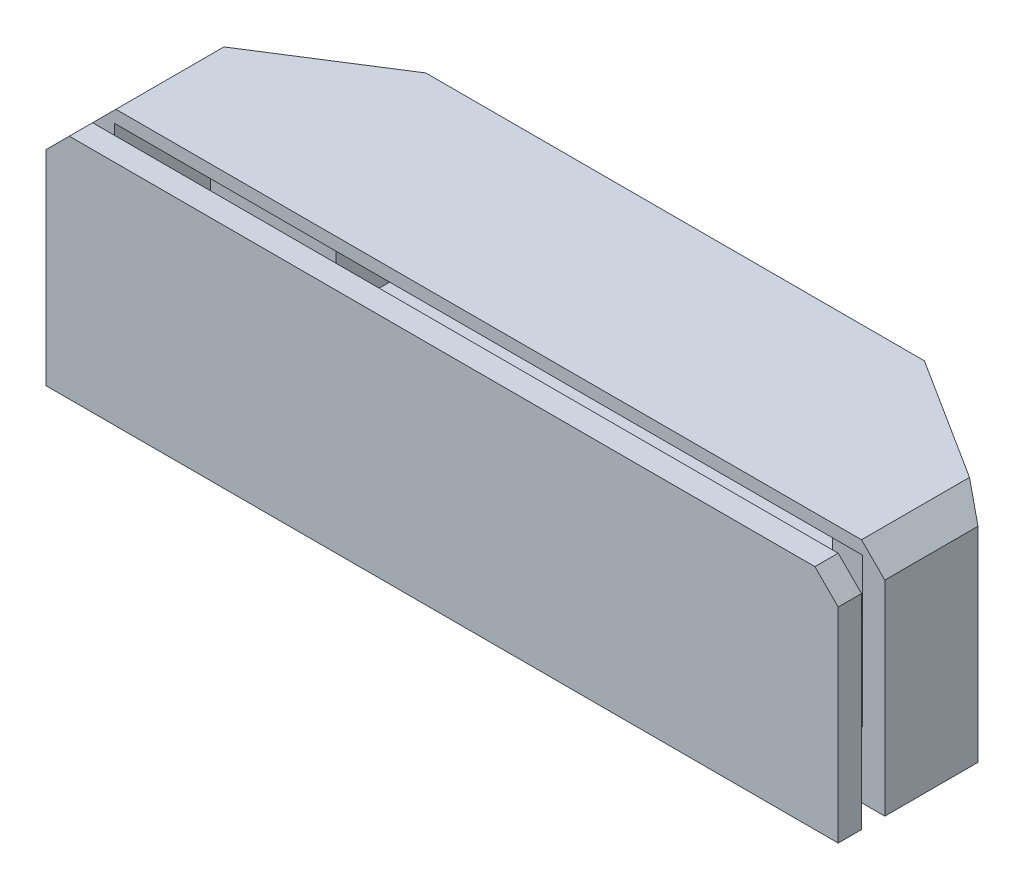
ISO-10303-21;
HEADER;
FILE_DESCRIPTION(('STEP AP214'),'2;1');
FILE_NAME('part.step','',(''),(''),'','','');
FILE_SCHEMA(('AUTOMOTIVE_DESIGN { 1 0 10303 214 1 1 1 1 }'));
ENDSEC;
DATA;
#1=APPLICATION_CONTEXT('core data for automotive mechanical design processes');
#2=APPLICATION_PROTOCOL_DEFINITION('international standard','automotive_design',2000,#1);
#3=PRODUCT_CONTEXT('',#1,'mechanical');
#4=PRODUCT('Part','Part','',(#3));
#5=PRODUCT_RELATED_PRODUCT_CATEGORY('part','',(#4));
#6=PRODUCT_DEFINITION_FORMATION('','',#4);
#7=PRODUCT_DEFINITION_CONTEXT('part definition',#1,'design');
#8=PRODUCT_DEFINITION('design','',#6,#7);
#9=PRODUCT_DEFINITION_SHAPE('','',#8);
#10=(LENGTH_UNIT() NAMED_UNIT(*) SI_UNIT(.MILLI.,.METRE.));
#11=(NAMED_UNIT(*) PLANE_ANGLE_UNIT() SI_UNIT($,.RADIAN.));
#12=(NAMED_UNIT(*) SI_UNIT($,.STERADIAN.) SOLID_ANGLE_UNIT());
#13=UNCERTAINTY_MEASURE_WITH_UNIT(LENGTH_MEASURE(1.E-05),#10,'distance_accuracy_value','');
#14=(GEOMETRIC_REPRESENTATION_CONTEXT(3) GLOBAL_UNCERTAINTY_ASSIGNED_CONTEXT((#13)) GLOBAL_UNIT_ASSIGNED_CONTEXT((#10,
#11,#12)) REPRESENTATION_CONTEXT('',''));
#15=CARTESIAN_POINT('',(0.,0.,0.));
#16=DIRECTION('',(0.,0.,1.));
#17=DIRECTION('',(1.,0.,0.));
#18=AXIS2_PLACEMENT_3D('',#15,#16,#17);
#19=CARTESIAN_POINT('',(-34.,-12.05,11.9446162465853));
#20=DIRECTION('',(0.,1.,0.));
#21=DIRECTION('',(0.,0.,1.));
#22=AXIS2_PLACEMENT_3D('',#19,#20,#21);
#23=PLANE('',#22);
#24=DIRECTION('',(1.,0.,0.));
#25=VECTOR('',#24,1.);
#26=CARTESIAN_POINT('',(-34.,-12.05,9.94461624658526));
#27=LINE('',#26,#25);
#28=CARTESIAN_POINT('',(-34.,-12.05,9.94461624658526));
#29=VERTEX_POINT('',#28);
#30=CARTESIAN_POINT('',(34.,-12.05,9.94461624658526));
#31=VERTEX_POINT('',#30);
#32=EDGE_CURVE('E123',#29,#31,#27,.T.);
#33=ORIENTED_EDGE('',*,*,#32,.T.);
#34=DIRECTION('',(0.,0.,-1.));
#35=VECTOR('',#34,1.);
#36=CARTESIAN_POINT('',(34.,-12.05,11.9446162465853));
#37=LINE('',#36,#35);
#38=CARTESIAN_POINT('',(34.,-12.05,11.9446162465853));
#39=VERTEX_POINT('',#38);
#40=EDGE_CURVE('E108',#39,#31,#37,.T.);
#41=ORIENTED_EDGE('',*,*,#40,.F.);
#42=DIRECTION('',(1.,0.,0.));
#43=VECTOR('',#42,1.);
#44=CARTESIAN_POINT('',(-34.,-12.05,11.9446162465853));
#45=LINE('',#44,#43);
#46=CARTESIAN_POINT('',(-34.,-12.05,11.9446162465853));
#47=VERTEX_POINT('',#46);
#48=EDGE_CURVE('E112',#47,#39,#45,.T.);
#49=ORIENTED_EDGE('',*,*,#48,.F.);
#50=DIRECTION('',(0.,0.,-1.));
#51=VECTOR('',#50,1.);
#52=CARTESIAN_POINT('',(-34.,-12.05,11.9446162465853));
#53=LINE('',#52,#51);
#54=EDGE_CURVE('E125',#47,#29,#53,.T.);
#55=ORIENTED_EDGE('',*,*,#54,.T.);
#56=EDGE_LOOP('',(#33,#41,#49,#55));
#57=FACE_BOUND('',#56,.T.);
#58=ADVANCED_FACE('F50',(#57),#23,.F.);
#59=CARTESIAN_POINT('',(34.,-12.05,11.9446162465853));
#60=DIRECTION('',(-1.,0.,0.));
#61=DIRECTION('',(0.,0.,1.));
#62=AXIS2_PLACEMENT_3D('',#59,#60,#61);
#63=PLANE('',#62);
#64=DIRECTION('',(0.,1.,0.));
#65=VECTOR('',#64,1.);
#66=CARTESIAN_POINT('',(34.,-12.05,9.94461624658526));
#67=LINE('',#66,#65);
#68=CARTESIAN_POINT('',(34.,5.49999999999999,9.94461624658526));
#69=VERTEX_POINT('',#68);
#70=EDGE_CURVE('E151',#31,#69,#67,.T.);
#71=ORIENTED_EDGE('',*,*,#70,.T.);
#72=DIRECTION('',(0.,0.,1.));
#73=VECTOR('',#72,1.);
#74=CARTESIAN_POINT('',(34.,5.49999999999999,11.9446162465853));
#75=LINE('',#74,#73);
#76=CARTESIAN_POINT('',(34.,5.49999999999999,11.9446162465853));
#77=VERTEX_POINT('',#76);
#78=EDGE_CURVE('E74',#69,#77,#75,.T.);
#79=ORIENTED_EDGE('',*,*,#78,.T.);
#80=DIRECTION('',(0.,1.,0.));
#81=VECTOR('',#80,1.);
#82=CARTESIAN_POINT('',(34.,-12.05,11.9446162465853));
#83=LINE('',#82,#81);
#84=EDGE_CURVE('E104',#39,#77,#83,.T.);
#85=ORIENTED_EDGE('',*,*,#84,.F.);
#86=ORIENTED_EDGE('',*,*,#40,.T.);
#87=EDGE_LOOP('',(#71,#79,#85,#86));
#88=FACE_BOUND('',#87,.T.);
#89=ADVANCED_FACE('F106',(#88),#63,.F.);
#90=CARTESIAN_POINT('',(34.,7.5,11.9446162465853));
#91=DIRECTION('',(0.,-1.,0.));
#92=DIRECTION('',(0.,0.,-1.));
#93=AXIS2_PLACEMENT_3D('',#90,#91,#92);
#94=PLANE('',#93);
#95=DIRECTION('',(-1.,0.,0.));
#96=VECTOR('',#95,1.);
#97=CARTESIAN_POINT('',(34.,7.5,11.9446162465853));
#98=LINE('',#97,#96);
#99=CARTESIAN_POINT('',(32.,7.5,11.9446162465853));
#100=VERTEX_POINT('',#99);
#101=CARTESIAN_POINT('',(-32.,7.5,11.9446162465853));
#102=VERTEX_POINT('',#101);
#103=EDGE_CURVE('E111',#100,#102,#98,.T.);
#104=ORIENTED_EDGE('',*,*,#103,.F.);
#105=DIRECTION('',(0.,0.,-1.));
#106=VECTOR('',#105,1.);
#107=CARTESIAN_POINT('',(32.,7.5,11.9446162465853));
#108=LINE('',#107,#106);
#109=CARTESIAN_POINT('',(32.,7.5,9.94461624658526));
#110=VERTEX_POINT('',#109);
#111=EDGE_CURVE('E127',#100,#110,#108,.T.);
#112=ORIENTED_EDGE('',*,*,#111,.T.);
#113=DIRECTION('',(-1.,0.,0.));
#114=VECTOR('',#113,1.);
#115=CARTESIAN_POINT('',(34.,7.5,9.94461624658526));
#116=LINE('',#115,#114);
#117=CARTESIAN_POINT('',(-32.,7.5,9.94461624658526));
#118=VERTEX_POINT('',#117);
#119=EDGE_CURVE('E152',#110,#118,#116,.T.);
#120=ORIENTED_EDGE('',*,*,#119,.T.);
#121=DIRECTION('',(0.,0.,1.));
#122=VECTOR('',#121,1.);
#123=CARTESIAN_POINT('',(-32.,7.5,11.9446162465853));
#124=LINE('',#123,#122);
#125=EDGE_CURVE('E124',#118,#102,#124,.T.);
#126=ORIENTED_EDGE('',*,*,#125,.T.);
#127=EDGE_LOOP('',(#104,#112,#120,#126));
#128=FACE_BOUND('',#127,.T.);
#129=ADVANCED_FACE('F143',(#128),#94,.F.);
#130=CARTESIAN_POINT('',(-34.,7.5,11.9446162465853));
#131=DIRECTION('',(1.,0.,0.));
#132=DIRECTION('',(0.,0.,-1.));
#133=AXIS2_PLACEMENT_3D('',#130,#131,#132);
#134=PLANE('',#133);
#135=DIRECTION('',(0.,-1.,0.));
#136=VECTOR('',#135,1.);
#137=CARTESIAN_POINT('',(-34.,7.5,11.9446162465853));
#138=LINE('',#137,#136);
#139=CARTESIAN_POINT('',(-34.,5.5,11.9446162465853));
#140=VERTEX_POINT('',#139);
#141=EDGE_CURVE('E116',#140,#47,#138,.T.);
#142=ORIENTED_EDGE('',*,*,#141,.F.);
#143=DIRECTION('',(0.,0.,-1.));
#144=VECTOR('',#143,1.);
#145=CARTESIAN_POINT('',(-34.,5.5,11.9446162465853));
#146=LINE('',#145,#144);
#147=CARTESIAN_POINT('',(-34.,5.5,9.94461624658526));
#148=VERTEX_POINT('',#147);
#149=EDGE_CURVE('E12',#140,#148,#146,.T.);
#150=ORIENTED_EDGE('',*,*,#149,.T.);
#151=DIRECTION('',(0.,-1.,0.));
#152=VECTOR('',#151,1.);
#153=CARTESIAN_POINT('',(-34.,7.5,9.94461624658526));
#154=LINE('',#153,#152);
#155=EDGE_CURVE('E120',#148,#29,#154,.T.);
#156=ORIENTED_EDGE('',*,*,#155,.T.);
#157=ORIENTED_EDGE('',*,*,#54,.F.);
#158=EDGE_LOOP('',(#142,#150,#156,#157));
#159=FACE_BOUND('',#158,.T.);
#160=ADVANCED_FACE('F159',(#159),#134,.F.);
#161=CARTESIAN_POINT('',(0.,0.,11.9446162465853));
#162=DIRECTION('',(0.,0.,1.));
#163=DIRECTION('',(1.,0.,0.));
#164=AXIS2_PLACEMENT_3D('',#161,#162,#163);
#165=PLANE('',#164);
#166=ORIENTED_EDGE('',*,*,#84,.T.);
#167=DIRECTION('',(0.707106781186546,-0.707106781186549,0.));
#168=VECTOR('',#167,1.);
#169=CARTESIAN_POINT('',(19.7500000000001,19.75,11.9446162465853));
#170=LINE('',#169,#168);
#171=EDGE_CURVE('E59',#77,#100,#170,.F.);
#172=ORIENTED_EDGE('',*,*,#171,.T.);
#173=ORIENTED_EDGE('',*,*,#103,.T.);
#174=DIRECTION('',(0.707106781186548,0.707106781186548,0.));
#175=VECTOR('',#174,1.);
#176=CARTESIAN_POINT('',(-19.75,19.75,11.9446162465853));
#177=LINE('',#176,#175);
#178=EDGE_CURVE('E66',#102,#140,#177,.F.);
#179=ORIENTED_EDGE('',*,*,#178,.T.);
#180=ORIENTED_EDGE('',*,*,#141,.T.);
#181=ORIENTED_EDGE('',*,*,#48,.T.);
#182=EDGE_LOOP('',(#166,#172,#173,#179,#180,#181));
#183=FACE_BOUND('',#182,.T.);
#184=ADVANCED_FACE('F115',(#183),#165,.T.);
#185=CARTESIAN_POINT('',(0.,0.,9.94461624658526));
#186=DIRECTION('',(0.,0.,1.));
#187=DIRECTION('',(1.,0.,0.));
#188=AXIS2_PLACEMENT_3D('',#185,#186,#187);
#189=PLANE('',#188);
#190=ORIENTED_EDGE('',*,*,#119,.F.);
#191=DIRECTION('',(-0.707106781186546,0.707106781186549,0.));
#192=VECTOR('',#191,1.);
#193=CARTESIAN_POINT('',(32.,7.5,9.94461624658526));
#194=LINE('',#193,#192);
#195=EDGE_CURVE('E136',#110,#69,#194,.F.);
#196=ORIENTED_EDGE('',*,*,#195,.T.);
#197=ORIENTED_EDGE('',*,*,#70,.F.);
#198=ORIENTED_EDGE('',*,*,#32,.F.);
#199=ORIENTED_EDGE('',*,*,#155,.F.);
#200=DIRECTION('',(-0.707106781186548,-0.707106781186548,0.));
#201=VECTOR('',#200,1.);
#202=CARTESIAN_POINT('',(-34.,5.5,9.94461624658526));
#203=LINE('',#202,#201);
#204=EDGE_CURVE('E134',#148,#118,#203,.F.);
#205=ORIENTED_EDGE('',*,*,#204,.T.);
#206=EDGE_LOOP('',(#190,#196,#197,#198,#199,#205));
#207=FACE_BOUND('',#206,.T.);
#208=ADVANCED_FACE('F150',(#207),#189,.F.);
#209=CARTESIAN_POINT('',(32.,7.5,11.9446162465853));
#210=DIRECTION('',(-0.707106781186549,-0.707106781186546,0.));
#211=DIRECTION('',(0.,0.,-1.));
#212=AXIS2_PLACEMENT_3D('',#209,#210,#211);
#213=PLANE('',#212);
#214=ORIENTED_EDGE('',*,*,#171,.F.);
#215=ORIENTED_EDGE('',*,*,#78,.F.);
#216=ORIENTED_EDGE('',*,*,#195,.F.);
#217=ORIENTED_EDGE('',*,*,#111,.F.);
#218=EDGE_LOOP('',(#214,#215,#216,#217));
#219=FACE_BOUND('',#218,.T.);
#220=ADVANCED_FACE('F148',(#219),#213,.F.);
#221=CARTESIAN_POINT('',(-34.,5.5,11.9446162465853));
#222=DIRECTION('',(0.707106781186547,-0.707106781186547,0.));
#223=DIRECTION('',(0.,0.,-1.));
#224=AXIS2_PLACEMENT_3D('',#221,#222,#223);
#225=PLANE('',#224);
#226=ORIENTED_EDGE('',*,*,#178,.F.);
#227=ORIENTED_EDGE('',*,*,#125,.F.);
#228=ORIENTED_EDGE('',*,*,#204,.F.);
#229=ORIENTED_EDGE('',*,*,#149,.F.);
#230=EDGE_LOOP('',(#226,#227,#228,#229));
#231=FACE_BOUND('',#230,.T.);
#232=ADVANCED_FACE('F53',(#231),#225,.F.);
#233=CLOSED_SHELL('',(#58,#89,#129,#160,#184,#208,#220,#232));
#234=MANIFOLD_SOLID_BREP('B2',#233);
#235=CARTESIAN_POINT('',(21.3,6.4,-7.2));
#236=DIRECTION('',(1.,0.,0.));
#237=DIRECTION('',(0.,1.,0.));
#238=AXIS2_PLACEMENT_3D('',#235,#236,#237);
#239=PLANE('',#238);
#240=DIRECTION('',(0.,-1.,0.));
#241=VECTOR('',#240,1.);
#242=CARTESIAN_POINT('',(21.3,6.4,-0.25538375341474));
#243=LINE('',#242,#241);
#244=CARTESIAN_POINT('',(21.3,6.4,-0.25538375341474));
#245=VERTEX_POINT('',#244);
#246=CARTESIAN_POINT('',(21.3,-6.4,-0.25538375341474));
#247=VERTEX_POINT('',#246);
#248=EDGE_CURVE('E388',#245,#247,#243,.T.);
#249=ORIENTED_EDGE('',*,*,#248,.F.);
#250=DIRECTION('',(0.,0.,1.));
#251=VECTOR('',#250,1.);
#252=CARTESIAN_POINT('',(21.3,6.4,-7.2));
#253=LINE('',#252,#251);
#254=CARTESIAN_POINT('',(21.3,6.4,-7.2));
#255=VERTEX_POINT('',#254);
#256=EDGE_CURVE('E360',#255,#245,#253,.T.);
#257=ORIENTED_EDGE('',*,*,#256,.F.);
#258=DIRECTION('',(0.,1.,0.));
#259=VECTOR('',#258,1.);
#260=CARTESIAN_POINT('',(21.3,6.4,-7.2));
#261=LINE('',#260,#259);
#262=CARTESIAN_POINT('',(21.3,-6.4,-7.2));
#263=VERTEX_POINT('',#262);
#264=EDGE_CURVE('E394',#263,#255,#261,.T.);
#265=ORIENTED_EDGE('',*,*,#264,.F.);
#266=DIRECTION('',(0.,0.,1.));
#267=VECTOR('',#266,1.);
#268=CARTESIAN_POINT('',(21.3,-6.4,-7.2));
#269=LINE('',#268,#267);
#270=EDGE_CURVE('E406',#263,#247,#269,.T.);
#271=ORIENTED_EDGE('',*,*,#270,.T.);
#272=EDGE_LOOP('',(#249,#257,#265,#271));
#273=FACE_BOUND('',#272,.T.);
#274=ADVANCED_FACE('F231',(#273),#239,.F.);
#275=CARTESIAN_POINT('',(-21.3,6.4,-7.2));
#276=DIRECTION('',(-1.,0.,0.));
#277=DIRECTION('',(0.,0.,1.));
#278=AXIS2_PLACEMENT_3D('',#275,#276,#277);
#279=PLANE('',#278);
#280=DIRECTION('',(0.,1.,0.));
#281=VECTOR('',#280,1.);
#282=CARTESIAN_POINT('',(-21.3,6.4,-0.25538375341474));
#283=LINE('',#282,#281);
#284=CARTESIAN_POINT('',(-21.3,-6.4,-0.25538375341474));
#285=VERTEX_POINT('',#284);
#286=CARTESIAN_POINT('',(-21.3,6.4,-0.25538375341474));
#287=VERTEX_POINT('',#286);
#288=EDGE_CURVE('E381',#285,#287,#283,.T.);
#289=ORIENTED_EDGE('',*,*,#288,.F.);
#290=DIRECTION('',(0.,0.,1.));
#291=VECTOR('',#290,1.);
#292=CARTESIAN_POINT('',(-21.3,-6.4,-7.2));
#293=LINE('',#292,#291);
#294=CARTESIAN_POINT('',(-21.3,-6.4,-7.2));
#295=VERTEX_POINT('',#294);
#296=EDGE_CURVE('E410',#295,#285,#293,.T.);
#297=ORIENTED_EDGE('',*,*,#296,.F.);
#298=DIRECTION('',(0.,-1.,0.));
#299=VECTOR('',#298,1.);
#300=CARTESIAN_POINT('',(-21.3,6.4,-7.2));
#301=LINE('',#300,#299);
#302=CARTESIAN_POINT('',(-21.3,6.4,-7.2));
#303=VERTEX_POINT('',#302);
#304=EDGE_CURVE('E400',#303,#295,#301,.T.);
#305=ORIENTED_EDGE('',*,*,#304,.F.);
#306=DIRECTION('',(0.,0.,1.));
#307=VECTOR('',#306,1.);
#308=CARTESIAN_POINT('',(-21.3,6.4,-7.2));
#309=LINE('',#308,#307);
#310=EDGE_CURVE('E413',#303,#287,#309,.T.);
#311=ORIENTED_EDGE('',*,*,#310,.T.);
#312=EDGE_LOOP('',(#289,#297,#305,#311));
#313=FACE_BOUND('',#312,.T.);
#314=ADVANCED_FACE('F512',(#313),#279,.F.);
#315=CARTESIAN_POINT('',(34.,-12.05,7.94461624658526));
#316=DIRECTION('',(0.,0.,1.));
#317=DIRECTION('',(1.,0.,0.));
#318=AXIS2_PLACEMENT_3D('',#315,#316,#317);
#319=PLANE('',#318);
#320=DIRECTION('',(0.,1.,0.));
#321=VECTOR('',#320,1.);
#322=CARTESIAN_POINT('',(32.1,6.4,7.94461624658526));
#323=LINE('',#322,#321);
#324=CARTESIAN_POINT('',(32.1,-6.4,7.94461624658526));
#325=VERTEX_POINT('',#324);
#326=CARTESIAN_POINT('',(32.1,6.4,7.94461624658526));
#327=VERTEX_POINT('',#326);
#328=EDGE_CURVE('E351',#325,#327,#323,.T.);
#329=ORIENTED_EDGE('',*,*,#328,.F.);
#330=DIRECTION('',(1.,0.,0.));
#331=VECTOR('',#330,1.);
#332=CARTESIAN_POINT('',(-21.3,-6.4,7.94461624658526));
#333=LINE('',#332,#331);
#334=CARTESIAN_POINT('',(-32.1,-6.4,7.94461624658526));
#335=VERTEX_POINT('',#334);
#336=EDGE_CURVE('E392',#335,#325,#333,.T.);
#337=ORIENTED_EDGE('',*,*,#336,.F.);
#338=DIRECTION('',(0.,-1.,0.));
#339=VECTOR('',#338,1.);
#340=CARTESIAN_POINT('',(-32.1,6.4,7.94461624658526));
#341=LINE('',#340,#339);
#342=CARTESIAN_POINT('',(-32.1,6.4,7.94461624658526));
#343=VERTEX_POINT('',#342);
#344=EDGE_CURVE('E370',#343,#335,#341,.T.);
#345=ORIENTED_EDGE('',*,*,#344,.F.);
#346=DIRECTION('',(-1.,0.,0.));
#347=VECTOR('',#346,1.);
#348=CARTESIAN_POINT('',(-21.3,6.4,7.94461624658526));
#349=LINE('',#348,#347);
#350=EDGE_CURVE('E390',#327,#343,#349,.T.);
#351=ORIENTED_EDGE('',*,*,#350,.F.);
#352=EDGE_LOOP('',(#329,#337,#345,#351));
#353=FACE_BOUND('',#352,.T.);
#354=DIRECTION('',(0.,1.,0.));
#355=VECTOR('',#354,1.);
#356=CARTESIAN_POINT('',(34.,-12.05,7.94461624658526));
#357=LINE('',#356,#355);
#358=CARTESIAN_POINT('',(34.,-12.05,7.94461624658526));
#359=VERTEX_POINT('',#358);
#360=CARTESIAN_POINT('',(34.,5.49999999999997,7.94461624658526));
#361=VERTEX_POINT('',#360);
#362=EDGE_CURVE('E457',#359,#361,#357,.T.);
#363=ORIENTED_EDGE('',*,*,#362,.T.);
#364=DIRECTION('',(-0.707106781186546,0.707106781186549,0.));
#365=VECTOR('',#364,1.);
#366=CARTESIAN_POINT('',(42.775,-3.27500000000005,7.94461624658526));
#367=LINE('',#366,#365);
#368=CARTESIAN_POINT('',(32.,7.5,7.94461624658526));
#369=VERTEX_POINT('',#368);
#370=EDGE_CURVE('E471',#361,#369,#367,.T.);
#371=ORIENTED_EDGE('',*,*,#370,.T.);
#372=DIRECTION('',(1.,0.,0.));
#373=VECTOR('',#372,1.);
#374=CARTESIAN_POINT('',(34.,7.5,7.94461624658526));
#375=LINE('',#374,#373);
#376=CARTESIAN_POINT('',(-32.,7.5,7.94461624658526));
#377=VERTEX_POINT('',#376);
#378=EDGE_CURVE('E409',#377,#369,#375,.T.);
#379=ORIENTED_EDGE('',*,*,#378,.F.);
#380=DIRECTION('',(-0.707106781186546,-0.707106781186549,0.));
#381=VECTOR('',#380,1.);
#382=CARTESIAN_POINT('',(-8.77500000000011,30.725,7.94461624658526));
#383=LINE('',#382,#381);
#384=CARTESIAN_POINT('',(-34.,5.49999999999997,7.94461624658526));
#385=VERTEX_POINT('',#384);
#386=EDGE_CURVE('E254',#377,#385,#383,.T.);
#387=ORIENTED_EDGE('',*,*,#386,.T.);
#388=DIRECTION('',(0.,1.,0.));
#389=VECTOR('',#388,1.);
#390=CARTESIAN_POINT('',(-34.,-12.05,7.94461624658526));
#391=LINE('',#390,#389);
#392=CARTESIAN_POINT('',(-34.,-12.05,7.94461624658526));
#393=VERTEX_POINT('',#392);
#394=EDGE_CURVE('E445',#393,#385,#391,.T.);
#395=ORIENTED_EDGE('',*,*,#394,.F.);
#396=DIRECTION('',(1.,0.,0.));
#397=VECTOR('',#396,1.);
#398=CARTESIAN_POINT('',(34.,-12.05,7.94461624658526));
#399=LINE('',#398,#397);
#400=EDGE_CURVE('E430',#393,#359,#399,.T.);
#401=ORIENTED_EDGE('',*,*,#400,.T.);
#402=EDGE_LOOP('',(#363,#371,#379,#387,#395,#401));
#403=FACE_BOUND('',#402,.T.);
#404=ADVANCED_FACE('F473',(#353,#403),#319,.T.);
#405=CARTESIAN_POINT('',(-34.,-12.05,7.94461624658526));
#406=DIRECTION('',(-1.,0.,0.));
#407=DIRECTION('',(0.,0.,1.));
#408=AXIS2_PLACEMENT_3D('',#405,#406,#407);
#409=PLANE('',#408);
#410=ORIENTED_EDGE('',*,*,#394,.T.);
#411=DIRECTION('',(0.,0.,-1.));
#412=VECTOR('',#411,1.);
#413=CARTESIAN_POINT('',(-34.,5.49999999999997,-0.0553837534147412));
#414=LINE('',#413,#412);
#415=CARTESIAN_POINT('',(-34.,5.49999999999997,-0.0553837534147412));
#416=VERTEX_POINT('',#415);
#417=EDGE_CURVE('E240',#385,#416,#414,.T.);
#418=ORIENTED_EDGE('',*,*,#417,.T.);
#419=DIRECTION('',(0.,1.,0.));
#420=VECTOR('',#419,1.);
#421=CARTESIAN_POINT('',(-34.,-12.05,-0.0553837534147412));
#422=LINE('',#421,#420);
#423=CARTESIAN_POINT('',(-34.,-12.05,-0.0553837534147412));
#424=VERTEX_POINT('',#423);
#425=EDGE_CURVE('E446',#424,#416,#422,.T.);
#426=ORIENTED_EDGE('',*,*,#425,.F.);
#427=DIRECTION('',(0.,0.,1.));
#428=VECTOR('',#427,1.);
#429=CARTESIAN_POINT('',(-34.,-12.05,7.94461624658526));
#430=LINE('',#429,#428);
#431=EDGE_CURVE('E427',#424,#393,#430,.T.);
#432=ORIENTED_EDGE('',*,*,#431,.T.);
#433=EDGE_LOOP('',(#410,#418,#426,#432));
#434=FACE_BOUND('',#433,.T.);
#435=ADVANCED_FACE('F493',(#434),#409,.T.);
#436=CARTESIAN_POINT('',(-34.,-12.05,-0.0553837534147412));
#437=DIRECTION('',(-0.536008136665272,0.,-0.844212815247804));
#438=DIRECTION('',(-0.844212815247804,0.,0.536008136665272));
#439=AXIS2_PLACEMENT_3D('',#436,#437,#438);
#440=PLANE('',#439);
#441=ORIENTED_EDGE('',*,*,#425,.T.);
#442=DIRECTION('',(0.645077494405946,0.645077494405948,-0.409573012321235));
#443=VECTOR('',#442,1.);
#444=CARTESIAN_POINT('',(-41.3029932899979,-1.80299328999795,4.58143738309186));
#445=LINE('',#444,#443);
#446=CARTESIAN_POINT('',(-32.,7.5,-1.32522502325603));
#447=VERTEX_POINT('',#446);
#448=EDGE_CURVE('E48',#416,#447,#445,.T.);
#449=ORIENTED_EDGE('',*,*,#448,.T.);
#450=DIRECTION('',(-0.844212815247804,0.,0.536008136665272));
#451=VECTOR('',#450,1.);
#452=CARTESIAN_POINT('',(-34.,7.5,-0.0553837534147412));
#453=LINE('',#452,#451);
#454=CARTESIAN_POINT('',(-21.4,7.5,-8.05538375341474));
#455=VERTEX_POINT('',#454);
#456=EDGE_CURVE('E424',#455,#447,#453,.T.);
#457=ORIENTED_EDGE('',*,*,#456,.F.);
#458=DIRECTION('',(0.,1.,0.));
#459=VECTOR('',#458,1.);
#460=CARTESIAN_POINT('',(-21.4,-12.05,-8.05538375341474));
#461=LINE('',#460,#459);
#462=CARTESIAN_POINT('',(-21.4,-12.05,-8.05538375341474));
#463=VERTEX_POINT('',#462);
#464=EDGE_CURVE('E449',#463,#455,#461,.T.);
#465=ORIENTED_EDGE('',*,*,#464,.F.);
#466=DIRECTION('',(-0.844212815247804,0.,0.536008136665272));
#467=VECTOR('',#466,1.);
#468=CARTESIAN_POINT('',(-34.,-12.05,-0.0553837534147412));
#469=LINE('',#468,#467);
#470=EDGE_CURVE('E442',#463,#424,#469,.T.);
#471=ORIENTED_EDGE('',*,*,#470,.T.);
#472=EDGE_LOOP('',(#441,#449,#457,#465,#471));
#473=FACE_BOUND('',#472,.T.);
#474=ADVANCED_FACE('F498',(#473),#440,.T.);
#475=CARTESIAN_POINT('',(-21.4,-12.05,-8.05538375341474));
#476=DIRECTION('',(0.,0.,-1.));
#477=DIRECTION('',(-1.,0.,0.));
#478=AXIS2_PLACEMENT_3D('',#475,#476,#477);
#479=PLANE('',#478);
#480=ORIENTED_EDGE('',*,*,#464,.T.);
#481=DIRECTION('',(-1.,0.,0.));
#482=VECTOR('',#481,1.);
#483=CARTESIAN_POINT('',(-21.4,7.5,-8.05538375341474));
#484=LINE('',#483,#482);
#485=CARTESIAN_POINT('',(21.4,7.5,-8.05538375341474));
#486=VERTEX_POINT('',#485);
#487=EDGE_CURVE('E421',#486,#455,#484,.T.);
#488=ORIENTED_EDGE('',*,*,#487,.F.);
#489=DIRECTION('',(0.,1.,0.));
#490=VECTOR('',#489,1.);
#491=CARTESIAN_POINT('',(21.4,-12.05,-8.05538375341474));
#492=LINE('',#491,#490);
#493=CARTESIAN_POINT('',(21.4,-12.05,-8.05538375341474));
#494=VERTEX_POINT('',#493);
#495=EDGE_CURVE('E451',#494,#486,#492,.T.);
#496=ORIENTED_EDGE('',*,*,#495,.F.);
#497=DIRECTION('',(-1.,0.,0.));
#498=VECTOR('',#497,1.);
#499=CARTESIAN_POINT('',(-21.4,-12.05,-8.05538375341474));
#500=LINE('',#499,#498);
#501=EDGE_CURVE('E439',#494,#463,#500,.T.);
#502=ORIENTED_EDGE('',*,*,#501,.T.);
#503=EDGE_LOOP('',(#480,#488,#496,#502));
#504=FACE_BOUND('',#503,.T.);
#505=ADVANCED_FACE('F501',(#504),#479,.T.);
#506=CARTESIAN_POINT('',(21.4,-12.05,-8.05538375341474));
#507=DIRECTION('',(0.536008136665272,0.,-0.844212815247804));
#508=DIRECTION('',(-0.844212815247804,0.,-0.536008136665272));
#509=AXIS2_PLACEMENT_3D('',#506,#507,#508);
#510=PLANE('',#509);
#511=DIRECTION('',(-0.844212815247804,0.,-0.536008136665272));
#512=VECTOR('',#511,1.);
#513=CARTESIAN_POINT('',(21.4,7.5,-8.05538375341474));
#514=LINE('',#513,#512);
#515=CARTESIAN_POINT('',(32.,7.5,-1.32522502325602));
#516=VERTEX_POINT('',#515);
#517=EDGE_CURVE('E419',#516,#486,#514,.T.);
#518=ORIENTED_EDGE('',*,*,#517,.F.);
#519=DIRECTION('',(0.645077494405946,-0.645077494405948,0.409573012321235));
#520=VECTOR('',#519,1.);
#521=CARTESIAN_POINT('',(33.94616795974,5.55383204025997,-0.0895628265956943));
#522=LINE('',#521,#520);
#523=CARTESIAN_POINT('',(34.,5.49999999999997,-0.0553837534147412));
#524=VERTEX_POINT('',#523);
#525=EDGE_CURVE('E466',#516,#524,#522,.T.);
#526=ORIENTED_EDGE('',*,*,#525,.T.);
#527=DIRECTION('',(0.,1.,0.));
#528=VECTOR('',#527,1.);
#529=CARTESIAN_POINT('',(34.,-12.05,-0.0553837534147412));
#530=LINE('',#529,#528);
#531=CARTESIAN_POINT('',(34.,-12.05,-0.0553837534147412));
#532=VERTEX_POINT('',#531);
#533=EDGE_CURVE('E454',#532,#524,#530,.T.);
#534=ORIENTED_EDGE('',*,*,#533,.F.);
#535=DIRECTION('',(-0.844212815247804,0.,-0.536008136665272));
#536=VECTOR('',#535,1.);
#537=CARTESIAN_POINT('',(21.4,-12.05,-8.05538375341474));
#538=LINE('',#537,#536);
#539=EDGE_CURVE('E436',#532,#494,#538,.T.);
#540=ORIENTED_EDGE('',*,*,#539,.T.);
#541=ORIENTED_EDGE('',*,*,#495,.T.);
#542=EDGE_LOOP('',(#518,#526,#534,#540,#541));
#543=FACE_BOUND('',#542,.T.);
#544=ADVANCED_FACE('F483',(#543),#510,.T.);
#545=CARTESIAN_POINT('',(34.,-12.05,-0.0553837534147412));
#546=DIRECTION('',(1.,0.,0.));
#547=DIRECTION('',(0.,0.,-1.));
#548=AXIS2_PLACEMENT_3D('',#545,#546,#547);
#549=PLANE('',#548);
#550=ORIENTED_EDGE('',*,*,#533,.T.);
#551=DIRECTION('',(0.,0.,1.));
#552=VECTOR('',#551,1.);
#553=CARTESIAN_POINT('',(34.,5.49999999999997,7.94461624658526));
#554=LINE('',#553,#552);
#555=EDGE_CURVE('E468',#524,#361,#554,.T.);
#556=ORIENTED_EDGE('',*,*,#555,.T.);
#557=ORIENTED_EDGE('',*,*,#362,.F.);
#558=DIRECTION('',(0.,0.,-1.));
#559=VECTOR('',#558,1.);
#560=CARTESIAN_POINT('',(34.,-12.05,-0.0553837534147412));
#561=LINE('',#560,#559);
#562=EDGE_CURVE('E433',#359,#532,#561,.T.);
#563=ORIENTED_EDGE('',*,*,#562,.T.);
#564=EDGE_LOOP('',(#550,#556,#557,#563));
#565=FACE_BOUND('',#564,.T.);
#566=ADVANCED_FACE('F486',(#565),#549,.T.);
#567=CARTESIAN_POINT('',(0.,-12.05,0.));
#568=DIRECTION('',(0.,-1.,0.));
#569=DIRECTION('',(0.,0.,-1.));
#570=AXIS2_PLACEMENT_3D('',#567,#568,#569);
#571=PLANE('',#570);
#572=ORIENTED_EDGE('',*,*,#431,.F.);
#573=ORIENTED_EDGE('',*,*,#470,.F.);
#574=ORIENTED_EDGE('',*,*,#501,.F.);
#575=ORIENTED_EDGE('',*,*,#539,.F.);
#576=ORIENTED_EDGE('',*,*,#562,.F.);
#577=ORIENTED_EDGE('',*,*,#400,.F.);
#578=EDGE_LOOP('',(#572,#573,#574,#575,#576,#577));
#579=FACE_BOUND('',#578,.T.);
#580=ADVANCED_FACE('F491',(#579),#571,.T.);
#581=CARTESIAN_POINT('',(0.,7.5,0.));
#582=DIRECTION('',(0.,-1.,0.));
#583=DIRECTION('',(0.,0.,-1.));
#584=AXIS2_PLACEMENT_3D('',#581,#582,#583);
#585=PLANE('',#584);
#586=ORIENTED_EDGE('',*,*,#378,.T.);
#587=DIRECTION('',(0.,0.,-1.));
#588=VECTOR('',#587,1.);
#589=CARTESIAN_POINT('',(32.,7.5,-0.0553837534147412));
#590=LINE('',#589,#588);
#591=EDGE_CURVE('E463',#369,#516,#590,.T.);
#592=ORIENTED_EDGE('',*,*,#591,.T.);
#593=ORIENTED_EDGE('',*,*,#517,.T.);
#594=ORIENTED_EDGE('',*,*,#487,.T.);
#595=ORIENTED_EDGE('',*,*,#456,.T.);
#596=DIRECTION('',(0.,0.,1.));
#597=VECTOR('',#596,1.);
#598=CARTESIAN_POINT('',(-32.,7.5,7.94461624658526));
#599=LINE('',#598,#597);
#600=EDGE_CURVE('E448',#447,#377,#599,.T.);
#601=ORIENTED_EDGE('',*,*,#600,.T.);
#602=EDGE_LOOP('',(#586,#592,#593,#594,#595,#601));
#603=FACE_BOUND('',#602,.T.);
#604=ADVANCED_FACE('F478',(#603),#585,.F.);
#605=CARTESIAN_POINT('',(-21.3,-6.4,-7.2));
#606=DIRECTION('',(0.,-1.,0.));
#607=DIRECTION('',(0.,0.,-1.));
#608=AXIS2_PLACEMENT_3D('',#605,#606,#607);
#609=PLANE('',#608);
#610=ORIENTED_EDGE('',*,*,#336,.T.);
#611=DIRECTION('',(0.,0.,1.));
#612=VECTOR('',#611,1.);
#613=CARTESIAN_POINT('',(32.1,-6.4,-0.25538375341474));
#614=LINE('',#613,#612);
#615=CARTESIAN_POINT('',(32.1,-6.4,-0.25538375341474));
#616=VERTEX_POINT('',#615);
#617=EDGE_CURVE('E379',#616,#325,#614,.T.);
#618=ORIENTED_EDGE('',*,*,#617,.F.);
#619=DIRECTION('',(1.,0.,0.));
#620=VECTOR('',#619,1.);
#621=CARTESIAN_POINT('',(-32.1,-6.4,-0.25538375341474));
#622=LINE('',#621,#620);
#623=EDGE_CURVE('E368',#247,#616,#622,.T.);
#624=ORIENTED_EDGE('',*,*,#623,.F.);
#625=ORIENTED_EDGE('',*,*,#270,.F.);
#626=DIRECTION('',(1.,0.,0.));
#627=VECTOR('',#626,1.);
#628=CARTESIAN_POINT('',(-21.3,-6.4,-7.2));
#629=LINE('',#628,#627);
#630=EDGE_CURVE('E403',#295,#263,#629,.T.);
#631=ORIENTED_EDGE('',*,*,#630,.F.);
#632=ORIENTED_EDGE('',*,*,#296,.T.);
#633=CARTESIAN_POINT('',(-32.1,-6.4,-0.25538375341474));
#634=VERTEX_POINT('',#633);
#635=EDGE_CURVE('E354',#634,#285,#622,.T.);
#636=ORIENTED_EDGE('',*,*,#635,.F.);
#637=DIRECTION('',(0.,0.,1.));
#638=VECTOR('',#637,1.);
#639=CARTESIAN_POINT('',(-32.1,-6.4,-0.25538375341474));
#640=LINE('',#639,#638);
#641=EDGE_CURVE('E382',#634,#335,#640,.T.);
#642=ORIENTED_EDGE('',*,*,#641,.T.);
#643=EDGE_LOOP('',(#610,#618,#624,#625,#631,#632,#636,#642));
#644=FACE_BOUND('',#643,.T.);
#645=ADVANCED_FACE('F524',(#644),#609,.F.);
#646=CARTESIAN_POINT('',(-21.3,6.4,-7.2));
#647=DIRECTION('',(0.,1.,0.));
#648=DIRECTION('',(0.,0.,1.));
#649=AXIS2_PLACEMENT_3D('',#646,#647,#648);
#650=PLANE('',#649);
#651=ORIENTED_EDGE('',*,*,#350,.T.);
#652=DIRECTION('',(0.,0.,1.));
#653=VECTOR('',#652,1.);
#654=CARTESIAN_POINT('',(-32.1,6.4,-0.25538375341474));
#655=LINE('',#654,#653);
#656=CARTESIAN_POINT('',(-32.1,6.4,-0.25538375341474));
#657=VERTEX_POINT('',#656);
#658=EDGE_CURVE('E353',#657,#343,#655,.T.);
#659=ORIENTED_EDGE('',*,*,#658,.F.);
#660=DIRECTION('',(-1.,0.,0.));
#661=VECTOR('',#660,1.);
#662=CARTESIAN_POINT('',(-32.1,6.4,-0.25538375341474));
#663=LINE('',#662,#661);
#664=EDGE_CURVE('E364',#287,#657,#663,.T.);
#665=ORIENTED_EDGE('',*,*,#664,.F.);
#666=ORIENTED_EDGE('',*,*,#310,.F.);
#667=DIRECTION('',(-1.,0.,0.));
#668=VECTOR('',#667,1.);
#669=CARTESIAN_POINT('',(-21.3,6.4,-7.2));
#670=LINE('',#669,#668);
#671=EDGE_CURVE('E397',#255,#303,#670,.T.);
#672=ORIENTED_EDGE('',*,*,#671,.F.);
#673=ORIENTED_EDGE('',*,*,#256,.T.);
#674=CARTESIAN_POINT('',(32.1,6.4,-0.25538375341474));
#675=VERTEX_POINT('',#674);
#676=EDGE_CURVE('E357',#675,#245,#663,.T.);
#677=ORIENTED_EDGE('',*,*,#676,.F.);
#678=DIRECTION('',(0.,0.,1.));
#679=VECTOR('',#678,1.);
#680=CARTESIAN_POINT('',(32.1,6.4,-0.25538375341474));
#681=LINE('',#680,#679);
#682=EDGE_CURVE('E344',#675,#327,#681,.T.);
#683=ORIENTED_EDGE('',*,*,#682,.T.);
#684=EDGE_LOOP('',(#651,#659,#665,#666,#672,#673,#677,#683));
#685=FACE_BOUND('',#684,.T.);
#686=ADVANCED_FACE('F358',(#685),#650,.F.);
#687=CARTESIAN_POINT('',(0.,0.,-7.2));
#688=DIRECTION('',(0.,0.,1.));
#689=DIRECTION('',(1.,0.,0.));
#690=AXIS2_PLACEMENT_3D('',#687,#688,#689);
#691=PLANE('',#690);
#692=ORIENTED_EDGE('',*,*,#264,.T.);
#693=ORIENTED_EDGE('',*,*,#671,.T.);
#694=ORIENTED_EDGE('',*,*,#304,.T.);
#695=ORIENTED_EDGE('',*,*,#630,.T.);
#696=EDGE_LOOP('',(#692,#693,#694,#695));
#697=FACE_BOUND('',#696,.T.);
#698=ADVANCED_FACE('F554',(#697),#691,.T.);
#699=CARTESIAN_POINT('',(0.,0.,-0.25538375341474));
#700=DIRECTION('',(0.,0.,1.));
#701=DIRECTION('',(1.,0.,0.));
#702=AXIS2_PLACEMENT_3D('',#699,#700,#701);
#703=PLANE('',#702);
#704=ORIENTED_EDGE('',*,*,#288,.T.);
#705=ORIENTED_EDGE('',*,*,#664,.T.);
#706=DIRECTION('',(0.,-1.,0.));
#707=VECTOR('',#706,1.);
#708=CARTESIAN_POINT('',(-32.1,6.4,-0.25538375341474));
#709=LINE('',#708,#707);
#710=EDGE_CURVE('E363',#657,#634,#709,.T.);
#711=ORIENTED_EDGE('',*,*,#710,.T.);
#712=ORIENTED_EDGE('',*,*,#635,.T.);
#713=EDGE_LOOP('',(#704,#705,#711,#712));
#714=FACE_BOUND('',#713,.T.);
#715=ADVANCED_FACE('F551',(#714),#703,.T.);
#716=CARTESIAN_POINT('',(-32.1,6.4,-0.25538375341474));
#717=DIRECTION('',(-1.,0.,0.));
#718=DIRECTION('',(0.,0.,1.));
#719=AXIS2_PLACEMENT_3D('',#716,#717,#718);
#720=PLANE('',#719);
#721=ORIENTED_EDGE('',*,*,#344,.T.);
#722=ORIENTED_EDGE('',*,*,#641,.F.);
#723=ORIENTED_EDGE('',*,*,#710,.F.);
#724=ORIENTED_EDGE('',*,*,#658,.T.);
#725=EDGE_LOOP('',(#721,#722,#723,#724));
#726=FACE_BOUND('',#725,.T.);
#727=ADVANCED_FACE('F549',(#726),#720,.F.);
#728=ORIENTED_EDGE('',*,*,#248,.T.);
#729=ORIENTED_EDGE('',*,*,#623,.T.);
#730=DIRECTION('',(0.,1.,0.));
#731=VECTOR('',#730,1.);
#732=CARTESIAN_POINT('',(32.1,6.4,-0.25538375341474));
#733=LINE('',#732,#731);
#734=EDGE_CURVE('E349',#616,#675,#733,.T.);
#735=ORIENTED_EDGE('',*,*,#734,.T.);
#736=ORIENTED_EDGE('',*,*,#676,.T.);
#737=EDGE_LOOP('',(#728,#729,#735,#736));
#738=FACE_BOUND('',#737,.T.);
#739=ADVANCED_FACE('F366',(#738),#703,.T.);
#740=CARTESIAN_POINT('',(32.1,6.4,-0.25538375341474));
#741=DIRECTION('',(1.,0.,0.));
#742=DIRECTION('',(0.,0.,-1.));
#743=AXIS2_PLACEMENT_3D('',#740,#741,#742);
#744=PLANE('',#743);
#745=ORIENTED_EDGE('',*,*,#328,.T.);
#746=ORIENTED_EDGE('',*,*,#682,.F.);
#747=ORIENTED_EDGE('',*,*,#734,.F.);
#748=ORIENTED_EDGE('',*,*,#617,.T.);
#749=EDGE_LOOP('',(#745,#746,#747,#748));
#750=FACE_BOUND('',#749,.T.);
#751=ADVANCED_FACE('F346',(#750),#744,.F.);
#752=CARTESIAN_POINT('',(32.,7.5,0.));
#753=DIRECTION('',(0.707106781186549,0.707106781186546,0.));
#754=DIRECTION('',(0.,0.,1.));
#755=AXIS2_PLACEMENT_3D('',#752,#753,#754);
#756=PLANE('',#755);
#757=ORIENTED_EDGE('',*,*,#370,.F.);
#758=ORIENTED_EDGE('',*,*,#555,.F.);
#759=ORIENTED_EDGE('',*,*,#525,.F.);
#760=ORIENTED_EDGE('',*,*,#591,.F.);
#761=EDGE_LOOP('',(#757,#758,#759,#760));
#762=FACE_BOUND('',#761,.T.);
#763=ADVANCED_FACE('F481',(#762),#756,.T.);
#764=CARTESIAN_POINT('',(-32.,7.5,0.));
#765=DIRECTION('',(-0.707106781186549,0.707106781186546,0.));
#766=DIRECTION('',(0.,0.,-1.));
#767=AXIS2_PLACEMENT_3D('',#764,#765,#766);
#768=PLANE('',#767);
#769=ORIENTED_EDGE('',*,*,#448,.F.);
#770=ORIENTED_EDGE('',*,*,#417,.F.);
#771=ORIENTED_EDGE('',*,*,#386,.F.);
#772=ORIENTED_EDGE('',*,*,#600,.F.);
#773=EDGE_LOOP('',(#769,#770,#771,#772));
#774=FACE_BOUND('',#773,.T.);
#775=ADVANCED_FACE('F234',(#774),#768,.T.);
#776=CLOSED_SHELL('',(#274,#314,#404,#435,#474,#505,#544,#566,#580,#604,#645,#686,#698,#715,
#727,#739,#751,#763,#775));
#777=MANIFOLD_SOLID_BREP('B6_NOT_SHOWN',#776);
#778=ADVANCED_BREP_SHAPE_REPRESENTATION('',(#18,#234,#777),#14);
#779=SHAPE_DEFINITION_REPRESENTATION(#9,#778);
ENDSEC;
END-ISO-10303-21;
